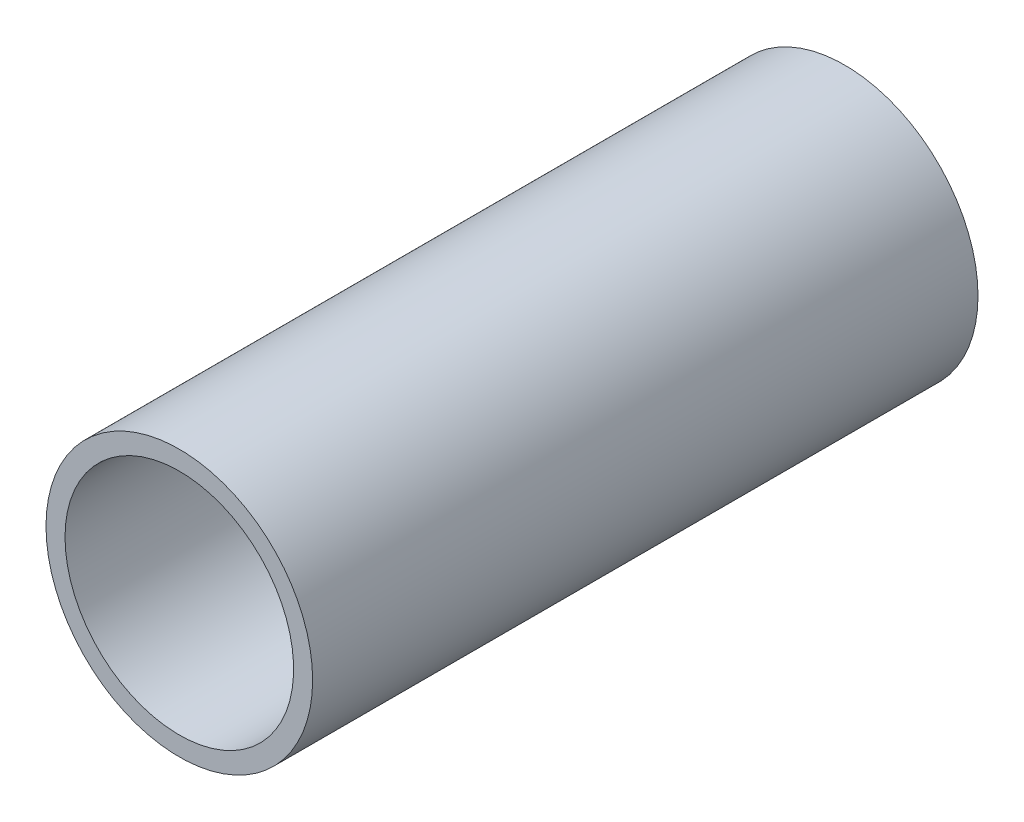
ISO-10303-21;
HEADER;
FILE_DESCRIPTION(('STEP AP214'),'2;1');
FILE_NAME('part.step','',(''),(''),'','','');
FILE_SCHEMA(('AUTOMOTIVE_DESIGN { 1 0 10303 214 1 1 1 1 }'));
ENDSEC;
DATA;
#1=APPLICATION_CONTEXT('core data for automotive mechanical design processes');
#2=APPLICATION_PROTOCOL_DEFINITION('international standard','automotive_design',2000,#1);
#3=PRODUCT_CONTEXT('',#1,'mechanical');
#4=PRODUCT('Part','Part','',(#3));
#5=PRODUCT_RELATED_PRODUCT_CATEGORY('part','',(#4));
#6=PRODUCT_DEFINITION_FORMATION('','',#4);
#7=PRODUCT_DEFINITION_CONTEXT('part definition',#1,'design');
#8=PRODUCT_DEFINITION('design','',#6,#7);
#9=PRODUCT_DEFINITION_SHAPE('','',#8);
#10=(LENGTH_UNIT() NAMED_UNIT(*) SI_UNIT(.MILLI.,.METRE.));
#11=(NAMED_UNIT(*) PLANE_ANGLE_UNIT() SI_UNIT($,.RADIAN.));
#12=(NAMED_UNIT(*) SI_UNIT($,.STERADIAN.) SOLID_ANGLE_UNIT());
#13=UNCERTAINTY_MEASURE_WITH_UNIT(LENGTH_MEASURE(1.E-05),#10,'distance_accuracy_value','');
#14=(GEOMETRIC_REPRESENTATION_CONTEXT(3) GLOBAL_UNCERTAINTY_ASSIGNED_CONTEXT((#13)) GLOBAL_UNIT_ASSIGNED_CONTEXT((#10,
#11,#12)) REPRESENTATION_CONTEXT('',''));
#15=CARTESIAN_POINT('',(0.,0.,0.));
#16=DIRECTION('',(0.,0.,1.));
#17=DIRECTION('',(1.,0.,0.));
#18=AXIS2_PLACEMENT_3D('',#15,#16,#17);
#19=CARTESIAN_POINT('',(0.,0.,0.));
#20=DIRECTION('',(0.,0.,-1.));
#21=DIRECTION('',(-1.,0.,0.));
#22=AXIS2_PLACEMENT_3D('',#19,#20,#21);
#23=CYLINDRICAL_SURFACE('',#22,38.18);
#24=CARTESIAN_POINT('',(0.,0.,0.));
#25=DIRECTION('',(0.,0.,-1.));
#26=DIRECTION('',(-1.,0.,0.));
#27=AXIS2_PLACEMENT_3D('',#24,#25,#26);
#28=CIRCLE('',#27,38.18);
#29=CARTESIAN_POINT('',(-38.18,0.,0.));
#30=VERTEX_POINT('',#29);
#31=EDGE_CURVE('E61',#30,#30,#28,.T.);
#32=ORIENTED_EDGE('',*,*,#31,.F.);
#33=EDGE_LOOP('',(#32));
#34=FACE_BOUND('',#33,.T.);
#35=CARTESIAN_POINT('',(0.,0.,-222.25));
#36=DIRECTION('',(0.,0.,-1.));
#37=DIRECTION('',(-1.,0.,0.));
#38=AXIS2_PLACEMENT_3D('',#35,#36,#37);
#39=CIRCLE('',#38,38.18);
#40=CARTESIAN_POINT('',(-38.18,0.,-222.25));
#41=VERTEX_POINT('',#40);
#42=EDGE_CURVE('E10',#41,#41,#39,.T.);
#43=ORIENTED_EDGE('',*,*,#42,.T.);
#44=EDGE_LOOP('',(#43));
#45=FACE_BOUND('',#44,.T.);
#46=ADVANCED_FACE('F43',(#34,#45),#23,.F.);
#47=CARTESIAN_POINT('',(38.18,0.,-222.25));
#48=DIRECTION('',(0.,0.,1.));
#49=DIRECTION('',(1.,0.,0.));
#50=AXIS2_PLACEMENT_3D('',#47,#48,#49);
#51=PLANE('',#50);
#52=ORIENTED_EDGE('',*,*,#42,.F.);
#53=EDGE_LOOP('',(#52));
#54=FACE_BOUND('',#53,.T.);
#55=CARTESIAN_POINT('',(0.,0.,-222.25));
#56=DIRECTION('',(0.,0.,-1.));
#57=DIRECTION('',(-1.,0.,0.));
#58=AXIS2_PLACEMENT_3D('',#55,#56,#57);
#59=CIRCLE('',#58,44.53);
#60=CARTESIAN_POINT('',(-44.53,0.,-222.25));
#61=VERTEX_POINT('',#60);
#62=EDGE_CURVE('E50',#61,#61,#59,.T.);
#63=ORIENTED_EDGE('',*,*,#62,.T.);
#64=EDGE_LOOP('',(#63));
#65=FACE_BOUND('',#64,.T.);
#66=ADVANCED_FACE('F70',(#54,#65),#51,.F.);
#67=CARTESIAN_POINT('',(0.,0.,0.));
#68=DIRECTION('',(0.,0.,-1.));
#69=DIRECTION('',(-1.,0.,0.));
#70=AXIS2_PLACEMENT_3D('',#67,#68,#69);
#71=CYLINDRICAL_SURFACE('',#70,44.53);
#72=ORIENTED_EDGE('',*,*,#62,.F.);
#73=EDGE_LOOP('',(#72));
#74=FACE_BOUND('',#73,.T.);
#75=CARTESIAN_POINT('',(0.,0.,0.));
#76=DIRECTION('',(0.,0.,-1.));
#77=DIRECTION('',(-1.,0.,0.));
#78=AXIS2_PLACEMENT_3D('',#75,#76,#77);
#79=CIRCLE('',#78,44.53);
#80=CARTESIAN_POINT('',(-44.53,0.,0.));
#81=VERTEX_POINT('',#80);
#82=EDGE_CURVE('E57',#81,#81,#79,.T.);
#83=ORIENTED_EDGE('',*,*,#82,.T.);
#84=EDGE_LOOP('',(#83));
#85=FACE_BOUND('',#84,.T.);
#86=ADVANCED_FACE('F74',(#74,#85),#71,.T.);
#87=CARTESIAN_POINT('',(38.18,0.,0.));
#88=DIRECTION('',(0.,0.,-1.));
#89=DIRECTION('',(-1.,0.,0.));
#90=AXIS2_PLACEMENT_3D('',#87,#88,#89);
#91=PLANE('',#90);
#92=ORIENTED_EDGE('',*,*,#82,.F.);
#93=EDGE_LOOP('',(#92));
#94=FACE_BOUND('',#93,.T.);
#95=ORIENTED_EDGE('',*,*,#31,.T.);
#96=EDGE_LOOP('',(#95));
#97=FACE_BOUND('',#96,.T.);
#98=ADVANCED_FACE('F67',(#94,#97),#91,.F.);
#99=CLOSED_SHELL('',(#46,#66,#86,#98));
#100=MANIFOLD_SOLID_BREP('B2',#99);
#101=ADVANCED_BREP_SHAPE_REPRESENTATION('',(#18,#100),#14);
#102=SHAPE_DEFINITION_REPRESENTATION(#9,#101);
ENDSEC;
END-ISO-10303-21;
